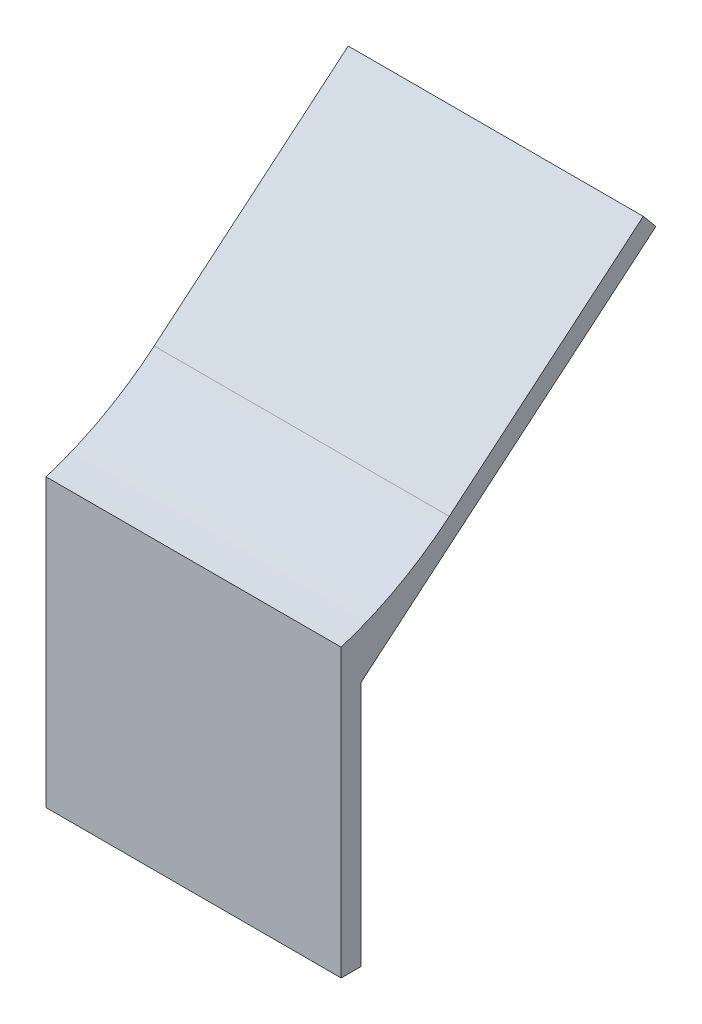
ISO-10303-21;
HEADER;
FILE_DESCRIPTION(('STEP AP214'),'2;1');
FILE_NAME('part.step','',(''),(''),'','','');
FILE_SCHEMA(('AUTOMOTIVE_DESIGN { 1 0 10303 214 1 1 1 1 }'));
ENDSEC;
DATA;
#1=APPLICATION_CONTEXT('core data for automotive mechanical design processes');
#2=APPLICATION_PROTOCOL_DEFINITION('international standard','automotive_design',2000,#1);
#3=PRODUCT_CONTEXT('',#1,'mechanical');
#4=PRODUCT('Part','Part','',(#3));
#5=PRODUCT_RELATED_PRODUCT_CATEGORY('part','',(#4));
#6=PRODUCT_DEFINITION_FORMATION('','',#4);
#7=PRODUCT_DEFINITION_CONTEXT('part definition',#1,'design');
#8=PRODUCT_DEFINITION('design','',#6,#7);
#9=PRODUCT_DEFINITION_SHAPE('','',#8);
#10=(LENGTH_UNIT() NAMED_UNIT(*) SI_UNIT(.MILLI.,.METRE.));
#11=(NAMED_UNIT(*) PLANE_ANGLE_UNIT() SI_UNIT($,.RADIAN.));
#12=(NAMED_UNIT(*) SI_UNIT($,.STERADIAN.) SOLID_ANGLE_UNIT());
#13=UNCERTAINTY_MEASURE_WITH_UNIT(LENGTH_MEASURE(1.E-05),#10,'distance_accuracy_value','');
#14=(GEOMETRIC_REPRESENTATION_CONTEXT(3) GLOBAL_UNCERTAINTY_ASSIGNED_CONTEXT((#13)) GLOBAL_UNIT_ASSIGNED_CONTEXT((#10,
#11,#12)) REPRESENTATION_CONTEXT('',''));
#15=CARTESIAN_POINT('',(0.,0.,0.));
#16=DIRECTION('',(0.,0.,1.));
#17=DIRECTION('',(1.,0.,0.));
#18=AXIS2_PLACEMENT_3D('',#15,#16,#17);
#19=CARTESIAN_POINT('',(30.,0.,-2.));
#20=DIRECTION('',(0.,1.,0.));
#21=DIRECTION('',(0.,0.,1.));
#22=AXIS2_PLACEMENT_3D('',#19,#20,#21);
#23=PLANE('',#22);
#24=DIRECTION('',(0.,0.,-1.));
#25=VECTOR('',#24,1.);
#26=CARTESIAN_POINT('',(0.,0.,-2.));
#27=LINE('',#26,#25);
#28=CARTESIAN_POINT('',(0.,0.,0.));
#29=VERTEX_POINT('',#28);
#30=CARTESIAN_POINT('',(0.,0.,-2.));
#31=VERTEX_POINT('',#30);
#32=EDGE_CURVE('E123',#29,#31,#27,.T.);
#33=ORIENTED_EDGE('',*,*,#32,.T.);
#34=DIRECTION('',(-1.,0.,0.));
#35=VECTOR('',#34,1.);
#36=CARTESIAN_POINT('',(30.,0.,-2.));
#37=LINE('',#36,#35);
#38=CARTESIAN_POINT('',(30.,0.,-2.));
#39=VERTEX_POINT('',#38);
#40=EDGE_CURVE('E11',#39,#31,#37,.T.);
#41=ORIENTED_EDGE('',*,*,#40,.F.);
#42=DIRECTION('',(0.,0.,-1.));
#43=VECTOR('',#42,1.);
#44=CARTESIAN_POINT('',(30.,0.,-2.));
#45=LINE('',#44,#43);
#46=CARTESIAN_POINT('',(30.,0.,0.));
#47=VERTEX_POINT('',#46);
#48=EDGE_CURVE('E135',#47,#39,#45,.T.);
#49=ORIENTED_EDGE('',*,*,#48,.F.);
#50=DIRECTION('',(-1.,0.,0.));
#51=VECTOR('',#50,1.);
#52=CARTESIAN_POINT('',(30.,0.,0.));
#53=LINE('',#52,#51);
#54=EDGE_CURVE('E119',#47,#29,#53,.T.);
#55=ORIENTED_EDGE('',*,*,#54,.T.);
#56=EDGE_LOOP('',(#33,#41,#49,#55));
#57=FACE_BOUND('',#56,.T.);
#58=ADVANCED_FACE('F33',(#57),#23,.F.);
#59=CARTESIAN_POINT('',(30.,25.,-2.));
#60=DIRECTION('',(0.,0.,1.));
#61=DIRECTION('',(0.,-1.,0.));
#62=AXIS2_PLACEMENT_3D('',#59,#60,#61);
#63=PLANE('',#62);
#64=DIRECTION('',(0.,1.,0.));
#65=VECTOR('',#64,1.);
#66=CARTESIAN_POINT('',(0.,25.,-2.));
#67=LINE('',#66,#65);
#68=CARTESIAN_POINT('',(0.,25.,-2.));
#69=VERTEX_POINT('',#68);
#70=EDGE_CURVE('E126',#31,#69,#67,.T.);
#71=ORIENTED_EDGE('',*,*,#70,.T.);
#72=DIRECTION('',(-1.,0.,0.));
#73=VECTOR('',#72,1.);
#74=CARTESIAN_POINT('',(30.,25.,-2.));
#75=LINE('',#74,#73);
#76=CARTESIAN_POINT('',(30.,25.,-2.));
#77=VERTEX_POINT('',#76);
#78=EDGE_CURVE('E41',#77,#69,#75,.T.);
#79=ORIENTED_EDGE('',*,*,#78,.F.);
#80=DIRECTION('',(0.,1.,0.));
#81=VECTOR('',#80,1.);
#82=CARTESIAN_POINT('',(30.,25.,-2.));
#83=LINE('',#82,#81);
#84=EDGE_CURVE('E89',#39,#77,#83,.T.);
#85=ORIENTED_EDGE('',*,*,#84,.F.);
#86=ORIENTED_EDGE('',*,*,#40,.T.);
#87=EDGE_LOOP('',(#71,#79,#85,#86));
#88=FACE_BOUND('',#87,.T.);
#89=ADVANCED_FACE('F160',(#88),#63,.F.);
#90=CARTESIAN_POINT('',(30.,50.1729889353181,-32.));
#91=DIRECTION('',(0.,0.766044443118981,0.642787609686535));
#92=DIRECTION('',(0.,-0.642787609686535,0.766044443118982));
#93=AXIS2_PLACEMENT_3D('',#90,#91,#92);
#94=PLANE('',#93);
#95=DIRECTION('',(0.,0.642787609686535,-0.766044443118981));
#96=VECTOR('',#95,1.);
#97=CARTESIAN_POINT('',(0.,50.1729889353181,-32.));
#98=LINE('',#97,#96);
#99=CARTESIAN_POINT('',(0.,50.1729889353181,-32.));
#100=VERTEX_POINT('',#99);
#101=EDGE_CURVE('E128',#69,#100,#98,.T.);
#102=ORIENTED_EDGE('',*,*,#101,.T.);
#103=DIRECTION('',(-1.,0.,0.));
#104=VECTOR('',#103,1.);
#105=CARTESIAN_POINT('',(30.,50.1729889353181,-32.));
#106=LINE('',#105,#104);
#107=CARTESIAN_POINT('',(30.,50.1729889353181,-32.));
#108=VERTEX_POINT('',#107);
#109=EDGE_CURVE('E139',#108,#100,#106,.T.);
#110=ORIENTED_EDGE('',*,*,#109,.F.);
#111=DIRECTION('',(0.,0.642787609686535,-0.766044443118981));
#112=VECTOR('',#111,1.);
#113=CARTESIAN_POINT('',(30.,50.1729889353181,-32.));
#114=LINE('',#113,#112);
#115=EDGE_CURVE('E147',#77,#108,#114,.T.);
#116=ORIENTED_EDGE('',*,*,#115,.F.);
#117=ORIENTED_EDGE('',*,*,#78,.T.);
#118=EDGE_LOOP('',(#102,#110,#116,#117));
#119=FACE_BOUND('',#118,.T.);
#120=ADVANCED_FACE('F145',(#119),#94,.F.);
#121=CARTESIAN_POINT('',(30.,51.7050778215561,-30.7144247806269));
#122=DIRECTION('',(0.,-0.642787609686535,0.766044443118982));
#123=DIRECTION('',(0.,-0.766044443118982,-0.642787609686535));
#124=AXIS2_PLACEMENT_3D('',#121,#122,#123);
#125=PLANE('',#124);
#126=DIRECTION('',(0.,0.766044443118982,0.642787609686535));
#127=VECTOR('',#126,1.);
#128=CARTESIAN_POINT('',(0.,51.7050778215561,-30.7144247806269));
#129=LINE('',#128,#127);
#130=CARTESIAN_POINT('',(0.,51.7050778215561,-30.7144247806269));
#131=VERTEX_POINT('',#130);
#132=EDGE_CURVE('E130',#100,#131,#129,.T.);
#133=ORIENTED_EDGE('',*,*,#132,.T.);
#134=DIRECTION('',(-1.,0.,0.));
#135=VECTOR('',#134,1.);
#136=CARTESIAN_POINT('',(30.,51.7050778215561,-30.7144247806269));
#137=LINE('',#136,#135);
#138=CARTESIAN_POINT('',(30.,51.7050778215561,-30.7144247806269));
#139=VERTEX_POINT('',#138);
#140=EDGE_CURVE('E114',#139,#131,#137,.T.);
#141=ORIENTED_EDGE('',*,*,#140,.F.);
#142=DIRECTION('',(0.,0.766044443118982,0.642787609686535));
#143=VECTOR('',#142,1.);
#144=CARTESIAN_POINT('',(30.,51.7050778215561,-30.7144247806269));
#145=LINE('',#144,#143);
#146=EDGE_CURVE('E105',#108,#139,#145,.T.);
#147=ORIENTED_EDGE('',*,*,#146,.F.);
#148=ORIENTED_EDGE('',*,*,#109,.T.);
#149=EDGE_LOOP('',(#133,#141,#147,#148));
#150=FACE_BOUND('',#149,.T.);
#151=ADVANCED_FACE('F153',(#150),#125,.F.);
#152=CARTESIAN_POINT('',(30.,35.1544946856161,-10.990207868841));
#153=DIRECTION('',(0.,-0.766044443118982,-0.642787609686535));
#154=DIRECTION('',(0.,0.642787609686535,-0.766044443118982));
#155=AXIS2_PLACEMENT_3D('',#152,#153,#154);
#156=PLANE('',#155);
#157=DIRECTION('',(0.,-0.642787609686535,0.766044443118982));
#158=VECTOR('',#157,1.);
#159=CARTESIAN_POINT('',(0.,35.1544946856161,-10.990207868841));
#160=LINE('',#159,#158);
#161=CARTESIAN_POINT('',(0.,35.1544946856161,-10.990207868841));
#162=VERTEX_POINT('',#161);
#163=EDGE_CURVE('E113',#131,#162,#160,.T.);
#164=ORIENTED_EDGE('',*,*,#163,.T.);
#165=DIRECTION('',(-1.,0.,0.));
#166=VECTOR('',#165,1.);
#167=CARTESIAN_POINT('',(30.,35.1544946856161,-10.990207868841));
#168=LINE('',#167,#166);
#169=CARTESIAN_POINT('',(30.,35.1544946856161,-10.990207868841));
#170=VERTEX_POINT('',#169);
#171=EDGE_CURVE('E110',#170,#162,#168,.T.);
#172=ORIENTED_EDGE('',*,*,#171,.F.);
#173=DIRECTION('',(0.,-0.642787609686535,0.766044443118982));
#174=VECTOR('',#173,1.);
#175=CARTESIAN_POINT('',(30.,35.1544946856161,-10.990207868841));
#176=LINE('',#175,#174);
#177=EDGE_CURVE('E99',#139,#170,#176,.T.);
#178=ORIENTED_EDGE('',*,*,#177,.F.);
#179=ORIENTED_EDGE('',*,*,#140,.T.);
#180=EDGE_LOOP('',(#164,#172,#178,#179));
#181=FACE_BOUND('',#180,.T.);
#182=ADVANCED_FACE('F111',(#181),#156,.F.);
#183=CARTESIAN_POINT('',(30.,59.7128340773716,9.61668565710726));
#184=DIRECTION('',(-1.,0.,0.));
#185=DIRECTION('',(0.,0.,1.));
#186=AXIS2_PLACEMENT_3D('',#183,#184,#185);
#187=CYLINDRICAL_SURFACE('',#186,32.0586352558935);
#188=CARTESIAN_POINT('',(0.,59.7128340773716,9.61668565710726));
#189=DIRECTION('',(-1.,0.,0.));
#190=DIRECTION('',(0.,0.,-1.));
#191=AXIS2_PLACEMENT_3D('',#188,#189,#190);
#192=CIRCLE('',#191,32.0586352558935);
#193=CARTESIAN_POINT('',(0.,29.1305605934919,0.));
#194=VERTEX_POINT('',#193);
#195=EDGE_CURVE('E75',#162,#194,#192,.T.);
#196=ORIENTED_EDGE('',*,*,#195,.T.);
#197=DIRECTION('',(-1.,0.,0.));
#198=VECTOR('',#197,1.);
#199=CARTESIAN_POINT('',(30.,29.1305605934919,0.));
#200=LINE('',#199,#198);
#201=CARTESIAN_POINT('',(30.,29.1305605934919,0.));
#202=VERTEX_POINT('',#201);
#203=EDGE_CURVE('E115',#202,#194,#200,.T.);
#204=ORIENTED_EDGE('',*,*,#203,.F.);
#205=CARTESIAN_POINT('',(30.,59.7128340773716,9.61668565710726));
#206=DIRECTION('',(-1.,0.,0.));
#207=DIRECTION('',(0.,0.,-1.));
#208=AXIS2_PLACEMENT_3D('',#205,#206,#207);
#209=CIRCLE('',#208,32.0586352558935);
#210=EDGE_CURVE('E103',#170,#202,#209,.T.);
#211=ORIENTED_EDGE('',*,*,#210,.F.);
#212=ORIENTED_EDGE('',*,*,#171,.T.);
#213=EDGE_LOOP('',(#196,#204,#211,#212));
#214=FACE_BOUND('',#213,.T.);
#215=ADVANCED_FACE('F117',(#214),#187,.F.);
#216=CARTESIAN_POINT('',(30.,0.,0.));
#217=DIRECTION('',(0.,0.,-1.));
#218=DIRECTION('',(-1.,0.,0.));
#219=AXIS2_PLACEMENT_3D('',#216,#217,#218);
#220=PLANE('',#219);
#221=DIRECTION('',(0.,-1.,0.));
#222=VECTOR('',#221,1.);
#223=CARTESIAN_POINT('',(0.,0.,0.));
#224=LINE('',#223,#222);
#225=EDGE_CURVE('E81',#194,#29,#224,.T.);
#226=ORIENTED_EDGE('',*,*,#225,.T.);
#227=ORIENTED_EDGE('',*,*,#54,.F.);
#228=DIRECTION('',(0.,-1.,0.));
#229=VECTOR('',#228,1.);
#230=CARTESIAN_POINT('',(30.,0.,0.));
#231=LINE('',#230,#229);
#232=EDGE_CURVE('E49',#202,#47,#231,.T.);
#233=ORIENTED_EDGE('',*,*,#232,.F.);
#234=ORIENTED_EDGE('',*,*,#203,.T.);
#235=EDGE_LOOP('',(#226,#227,#233,#234));
#236=FACE_BOUND('',#235,.T.);
#237=ADVANCED_FACE('F174',(#236),#220,.F.);
#238=CARTESIAN_POINT('',(30.,59.7128340773716,9.61668565710726));
#239=DIRECTION('',(1.,0.,0.));
#240=DIRECTION('',(0.,0.,-1.));
#241=AXIS2_PLACEMENT_3D('',#238,#239,#240);
#242=PLANE('',#241);
#243=ORIENTED_EDGE('',*,*,#48,.T.);
#244=ORIENTED_EDGE('',*,*,#84,.T.);
#245=ORIENTED_EDGE('',*,*,#115,.T.);
#246=ORIENTED_EDGE('',*,*,#146,.T.);
#247=ORIENTED_EDGE('',*,*,#177,.T.);
#248=ORIENTED_EDGE('',*,*,#210,.T.);
#249=ORIENTED_EDGE('',*,*,#232,.T.);
#250=EDGE_LOOP('',(#243,#244,#245,#246,#247,#248,#249));
#251=FACE_BOUND('',#250,.T.);
#252=ADVANCED_FACE('F101',(#251),#242,.T.);
#253=CARTESIAN_POINT('',(0.,59.7128340773716,9.61668565710726));
#254=DIRECTION('',(1.,0.,0.));
#255=DIRECTION('',(0.,0.,-1.));
#256=AXIS2_PLACEMENT_3D('',#253,#254,#255);
#257=PLANE('',#256);
#258=ORIENTED_EDGE('',*,*,#32,.F.);
#259=ORIENTED_EDGE('',*,*,#225,.F.);
#260=ORIENTED_EDGE('',*,*,#195,.F.);
#261=ORIENTED_EDGE('',*,*,#163,.F.);
#262=ORIENTED_EDGE('',*,*,#132,.F.);
#263=ORIENTED_EDGE('',*,*,#101,.F.);
#264=ORIENTED_EDGE('',*,*,#70,.F.);
#265=EDGE_LOOP('',(#258,#259,#260,#261,#262,#263,#264));
#266=FACE_BOUND('',#265,.T.);
#267=ADVANCED_FACE('F151',(#266),#257,.F.);
#268=CLOSED_SHELL('',(#58,#89,#120,#151,#182,#215,#237,#252,#267));
#269=MANIFOLD_SOLID_BREP('B2',#268);
#270=ADVANCED_BREP_SHAPE_REPRESENTATION('',(#18,#269),#14);
#271=SHAPE_DEFINITION_REPRESENTATION(#9,#270);
ENDSEC;
END-ISO-10303-21;
